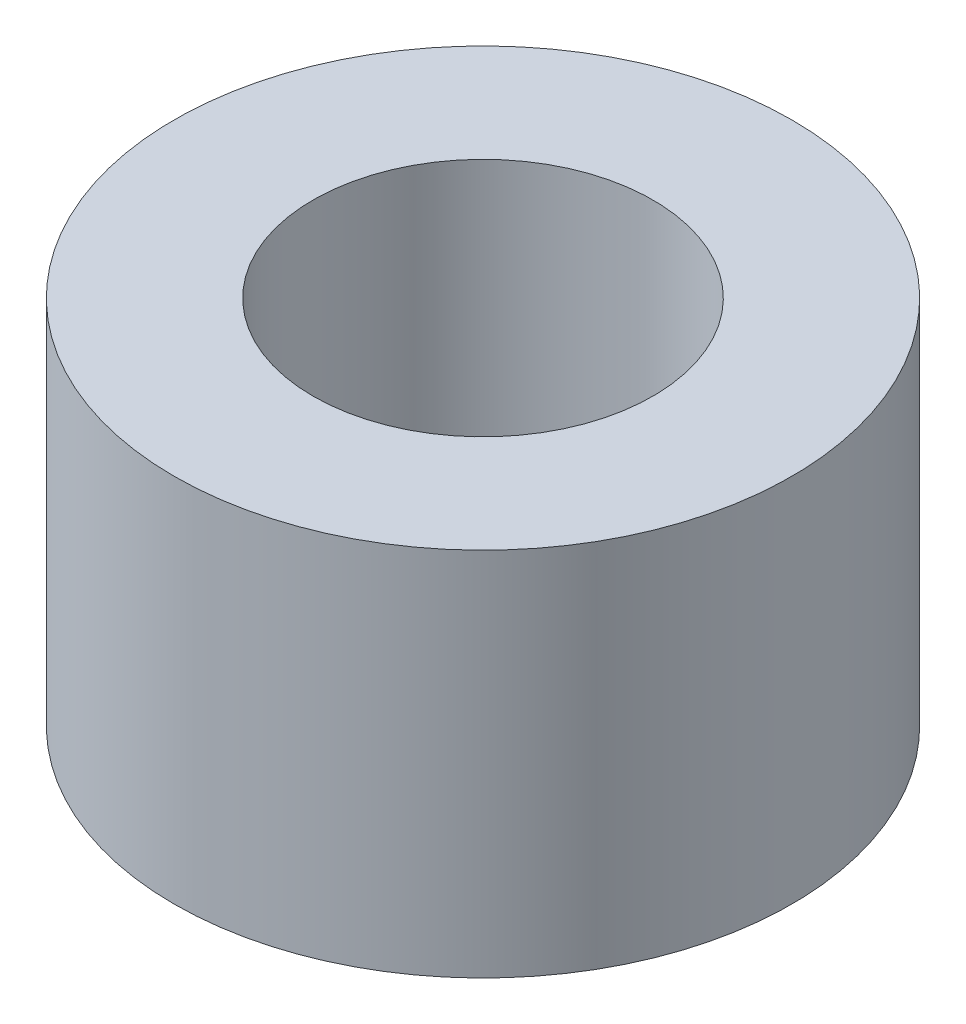
ISO-10303-21;
HEADER;
FILE_DESCRIPTION(('STEP AP214'),'2;1');
FILE_NAME('part.step','',(''),(''),'','','');
FILE_SCHEMA(('AUTOMOTIVE_DESIGN { 1 0 10303 214 1 1 1 1 }'));
ENDSEC;
DATA;
#1=APPLICATION_CONTEXT('core data for automotive mechanical design processes');
#2=APPLICATION_PROTOCOL_DEFINITION('international standard','automotive_design',2000,#1);
#3=PRODUCT_CONTEXT('',#1,'mechanical');
#4=PRODUCT('Part','Part','',(#3));
#5=PRODUCT_RELATED_PRODUCT_CATEGORY('part','',(#4));
#6=PRODUCT_DEFINITION_FORMATION('','',#4);
#7=PRODUCT_DEFINITION_CONTEXT('part definition',#1,'design');
#8=PRODUCT_DEFINITION('design','',#6,#7);
#9=PRODUCT_DEFINITION_SHAPE('','',#8);
#10=(LENGTH_UNIT() NAMED_UNIT(*) SI_UNIT(.MILLI.,.METRE.));
#11=(NAMED_UNIT(*) PLANE_ANGLE_UNIT() SI_UNIT($,.RADIAN.));
#12=(NAMED_UNIT(*) SI_UNIT($,.STERADIAN.) SOLID_ANGLE_UNIT());
#13=UNCERTAINTY_MEASURE_WITH_UNIT(LENGTH_MEASURE(1.E-05),#10,'distance_accuracy_value','');
#14=(GEOMETRIC_REPRESENTATION_CONTEXT(3) GLOBAL_UNCERTAINTY_ASSIGNED_CONTEXT((#13)) GLOBAL_UNIT_ASSIGNED_CONTEXT((#10,
#11,#12)) REPRESENTATION_CONTEXT('',''));
#15=CARTESIAN_POINT('',(0.,0.,0.));
#16=DIRECTION('',(0.,0.,1.));
#17=DIRECTION('',(1.,0.,0.));
#18=AXIS2_PLACEMENT_3D('',#15,#16,#17);
#19=CARTESIAN_POINT('',(0.,4.7625,0.));
#20=DIRECTION('',(0.,1.,0.));
#21=DIRECTION('',(0.,0.,1.));
#22=AXIS2_PLACEMENT_3D('',#19,#20,#21);
#23=PLANE('',#22);
#24=CARTESIAN_POINT('',(0.,4.7625,0.));
#25=DIRECTION('',(0.,1.,0.));
#26=DIRECTION('',(0.,0.,1.));
#27=AXIS2_PLACEMENT_3D('',#24,#25,#26);
#28=CIRCLE('',#27,3.96875);
#29=CARTESIAN_POINT('',(0.,4.7625,3.96875));
#30=VERTEX_POINT('',#29);
#31=EDGE_CURVE('E10',#30,#30,#28,.T.);
#32=ORIENTED_EDGE('',*,*,#31,.T.);
#33=EDGE_LOOP('',(#32));
#34=FACE_BOUND('',#33,.T.);
#35=CARTESIAN_POINT('',(0.,4.7625,0.));
#36=DIRECTION('',(0.,1.,0.));
#37=DIRECTION('',(0.,0.,1.));
#38=AXIS2_PLACEMENT_3D('',#35,#36,#37);
#39=CIRCLE('',#38,2.1844);
#40=CARTESIAN_POINT('',(0.,4.7625,2.1844));
#41=VERTEX_POINT('',#40);
#42=EDGE_CURVE('E41',#41,#41,#39,.T.);
#43=ORIENTED_EDGE('',*,*,#42,.F.);
#44=EDGE_LOOP('',(#43));
#45=FACE_BOUND('',#44,.T.);
#46=ADVANCED_FACE('F30',(#34,#45),#23,.T.);
#47=CARTESIAN_POINT('',(0.,0.,0.));
#48=DIRECTION('',(0.,1.,0.));
#49=DIRECTION('',(0.,0.,1.));
#50=AXIS2_PLACEMENT_3D('',#47,#48,#49);
#51=PLANE('',#50);
#52=CARTESIAN_POINT('',(0.,0.,0.));
#53=DIRECTION('',(0.,1.,0.));
#54=DIRECTION('',(0.,0.,1.));
#55=AXIS2_PLACEMENT_3D('',#52,#53,#54);
#56=CIRCLE('',#55,3.96875);
#57=CARTESIAN_POINT('',(0.,0.,3.96875));
#58=VERTEX_POINT('',#57);
#59=EDGE_CURVE('E34',#58,#58,#56,.T.);
#60=ORIENTED_EDGE('',*,*,#59,.F.);
#61=EDGE_LOOP('',(#60));
#62=FACE_BOUND('',#61,.T.);
#63=CARTESIAN_POINT('',(0.,0.,0.));
#64=DIRECTION('',(0.,1.,0.));
#65=DIRECTION('',(0.,0.,1.));
#66=AXIS2_PLACEMENT_3D('',#63,#64,#65);
#67=CIRCLE('',#66,2.1844);
#68=CARTESIAN_POINT('',(0.,0.,2.1844));
#69=VERTEX_POINT('',#68);
#70=EDGE_CURVE('E43',#69,#69,#67,.T.);
#71=ORIENTED_EDGE('',*,*,#70,.T.);
#72=EDGE_LOOP('',(#71));
#73=FACE_BOUND('',#72,.T.);
#74=ADVANCED_FACE('F53',(#62,#73),#51,.F.);
#75=CARTESIAN_POINT('',(0.,4.7625,0.));
#76=DIRECTION('',(0.,-1.,0.));
#77=DIRECTION('',(0.,0.,-1.));
#78=AXIS2_PLACEMENT_3D('',#75,#76,#77);
#79=CYLINDRICAL_SURFACE('',#78,3.96875);
#80=ORIENTED_EDGE('',*,*,#31,.F.);
#81=EDGE_LOOP('',(#80));
#82=FACE_BOUND('',#81,.T.);
#83=ORIENTED_EDGE('',*,*,#59,.T.);
#84=EDGE_LOOP('',(#83));
#85=FACE_BOUND('',#84,.T.);
#86=ADVANCED_FACE('F32',(#82,#85),#79,.T.);
#87=CARTESIAN_POINT('',(0.,4.7625,0.));
#88=DIRECTION('',(0.,-1.,0.));
#89=DIRECTION('',(0.,0.,-1.));
#90=AXIS2_PLACEMENT_3D('',#87,#88,#89);
#91=CYLINDRICAL_SURFACE('',#90,2.1844);
#92=ORIENTED_EDGE('',*,*,#42,.T.);
#93=EDGE_LOOP('',(#92));
#94=FACE_BOUND('',#93,.T.);
#95=ORIENTED_EDGE('',*,*,#70,.F.);
#96=EDGE_LOOP('',(#95));
#97=FACE_BOUND('',#96,.T.);
#98=ADVANCED_FACE('F49',(#94,#97),#91,.F.);
#99=CLOSED_SHELL('',(#46,#74,#86,#98));
#100=MANIFOLD_SOLID_BREP('B2',#99);
#101=ADVANCED_BREP_SHAPE_REPRESENTATION('',(#18,#100),#14);
#102=SHAPE_DEFINITION_REPRESENTATION(#9,#101);
ENDSEC;
END-ISO-10303-21;
